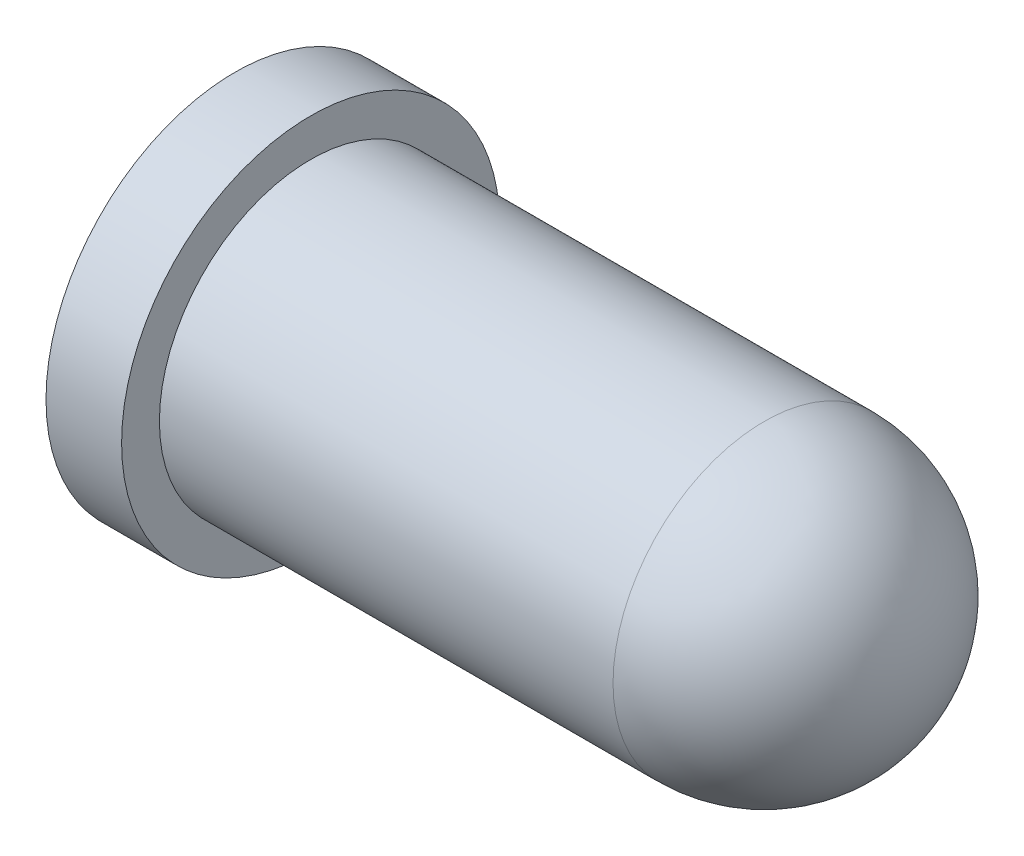
ISO-10303-21;
HEADER;
FILE_DESCRIPTION(('STEP AP214'),'2;1');
FILE_NAME('part.step','',(''),(''),'','','');
FILE_SCHEMA(('AUTOMOTIVE_DESIGN { 1 0 10303 214 1 1 1 1 }'));
ENDSEC;
DATA;
#1=APPLICATION_CONTEXT('core data for automotive mechanical design processes');
#2=APPLICATION_PROTOCOL_DEFINITION('international standard','automotive_design',2000,#1);
#3=PRODUCT_CONTEXT('',#1,'mechanical');
#4=PRODUCT('Part','Part','',(#3));
#5=PRODUCT_RELATED_PRODUCT_CATEGORY('part','',(#4));
#6=PRODUCT_DEFINITION_FORMATION('','',#4);
#7=PRODUCT_DEFINITION_CONTEXT('part definition',#1,'design');
#8=PRODUCT_DEFINITION('design','',#6,#7);
#9=PRODUCT_DEFINITION_SHAPE('','',#8);
#10=(LENGTH_UNIT() NAMED_UNIT(*) SI_UNIT(.MILLI.,.METRE.));
#11=(NAMED_UNIT(*) PLANE_ANGLE_UNIT() SI_UNIT($,.RADIAN.));
#12=(NAMED_UNIT(*) SI_UNIT($,.STERADIAN.) SOLID_ANGLE_UNIT());
#13=UNCERTAINTY_MEASURE_WITH_UNIT(LENGTH_MEASURE(1.E-05),#10,'distance_accuracy_value','');
#14=(GEOMETRIC_REPRESENTATION_CONTEXT(3) GLOBAL_UNCERTAINTY_ASSIGNED_CONTEXT((#13)) GLOBAL_UNIT_ASSIGNED_CONTEXT((#10,
#11,#12)) REPRESENTATION_CONTEXT('',''));
#15=CARTESIAN_POINT('',(0.,0.,0.));
#16=DIRECTION('',(0.,0.,1.));
#17=DIRECTION('',(1.,0.,0.));
#18=AXIS2_PLACEMENT_3D('',#15,#16,#17);
#19=CARTESIAN_POINT('',(1.,0.,0.));
#20=DIRECTION('',(-1.,0.,0.));
#21=DIRECTION('',(0.,0.,1.));
#22=AXIS2_PLACEMENT_3D('',#19,#20,#21);
#23=CYLINDRICAL_SURFACE('',#22,2.5);
#24=CARTESIAN_POINT('',(1.,0.,0.));
#25=DIRECTION('',(1.,0.,0.));
#26=DIRECTION('',(0.,0.,-1.));
#27=AXIS2_PLACEMENT_3D('',#24,#25,#26);
#28=CIRCLE('',#27,2.5);
#29=CARTESIAN_POINT('',(1.,0.,-2.5));
#30=VERTEX_POINT('',#29);
#31=EDGE_CURVE('E54',#30,#30,#28,.T.);
#32=ORIENTED_EDGE('',*,*,#31,.F.);
#33=EDGE_LOOP('',(#32));
#34=FACE_BOUND('',#33,.T.);
#35=CARTESIAN_POINT('',(0.,0.,0.));
#36=DIRECTION('',(1.,0.,0.));
#37=DIRECTION('',(0.,0.,-1.));
#38=AXIS2_PLACEMENT_3D('',#35,#36,#37);
#39=CIRCLE('',#38,2.5);
#40=CARTESIAN_POINT('',(0.,0.,-2.5));
#41=VERTEX_POINT('',#40);
#42=EDGE_CURVE('E60',#41,#41,#39,.T.);
#43=ORIENTED_EDGE('',*,*,#42,.T.);
#44=EDGE_LOOP('',(#43));
#45=FACE_BOUND('',#44,.T.);
#46=ADVANCED_FACE('F41',(#34,#45),#23,.T.);
#47=CARTESIAN_POINT('',(1.,0.,0.));
#48=DIRECTION('',(1.,0.,0.));
#49=DIRECTION('',(0.,0.,-1.));
#50=AXIS2_PLACEMENT_3D('',#47,#48,#49);
#51=PLANE('',#50);
#52=CARTESIAN_POINT('',(1.,0.,0.));
#53=DIRECTION('',(1.,0.,0.));
#54=DIRECTION('',(0.,0.,-1.));
#55=AXIS2_PLACEMENT_3D('',#52,#53,#54);
#56=CIRCLE('',#55,2.);
#57=CARTESIAN_POINT('',(1.,0.,-2.));
#58=VERTEX_POINT('',#57);
#59=EDGE_CURVE('E49',#58,#58,#56,.T.);
#60=ORIENTED_EDGE('',*,*,#59,.F.);
#61=EDGE_LOOP('',(#60));
#62=FACE_BOUND('',#61,.T.);
#63=ORIENTED_EDGE('',*,*,#31,.T.);
#64=EDGE_LOOP('',(#63));
#65=FACE_BOUND('',#64,.T.);
#66=ADVANCED_FACE('F70',(#62,#65),#51,.T.);
#67=CARTESIAN_POINT('',(0.,0.,0.));
#68=DIRECTION('',(1.,0.,0.));
#69=DIRECTION('',(0.,0.,-1.));
#70=AXIS2_PLACEMENT_3D('',#67,#68,#69);
#71=PLANE('',#70);
#72=ORIENTED_EDGE('',*,*,#42,.F.);
#73=EDGE_LOOP('',(#72));
#74=FACE_BOUND('',#73,.T.);
#75=ADVANCED_FACE('F67',(#74),#71,.F.);
#76=CARTESIAN_POINT('',(9.,0.,0.));
#77=DIRECTION('',(-1.,0.,0.));
#78=DIRECTION('',(0.,0.,1.));
#79=AXIS2_PLACEMENT_3D('',#76,#77,#78);
#80=CYLINDRICAL_SURFACE('',#79,2.);
#81=CARTESIAN_POINT('',(7.,0.,0.));
#82=DIRECTION('',(-1.,0.,0.));
#83=DIRECTION('',(0.,0.,1.));
#84=AXIS2_PLACEMENT_3D('',#81,#82,#83);
#85=CIRCLE('',#84,2.);
#86=CARTESIAN_POINT('',(7.,0.,2.));
#87=VERTEX_POINT('',#86);
#88=EDGE_CURVE('E10',#87,#87,#85,.T.);
#89=ORIENTED_EDGE('',*,*,#88,.T.);
#90=EDGE_LOOP('',(#89));
#91=FACE_BOUND('',#90,.T.);
#92=ORIENTED_EDGE('',*,*,#59,.T.);
#93=EDGE_LOOP('',(#92));
#94=FACE_BOUND('',#93,.T.);
#95=ADVANCED_FACE('F69',(#91,#94),#80,.T.);
#96=CARTESIAN_POINT('',(7.,0.,0.));
#97=DIRECTION('',(1.,0.,0.));
#98=DIRECTION('',(0.,0.,-1.));
#99=AXIS2_PLACEMENT_3D('',#96,#97,#98);
#100=SPHERICAL_SURFACE('',#99,2.);
#101=ORIENTED_EDGE('',*,*,#88,.F.);
#102=EDGE_LOOP('',(#101));
#103=FACE_BOUND('',#102,.T.);
#104=ADVANCED_FACE('F43',(#103),#100,.T.);
#105=CLOSED_SHELL('',(#46,#66,#75,#95,#104));
#106=MANIFOLD_SOLID_BREP('B2',#105);
#107=ADVANCED_BREP_SHAPE_REPRESENTATION('',(#18,#106),#14);
#108=SHAPE_DEFINITION_REPRESENTATION(#9,#107);
ENDSEC;
END-ISO-10303-21;
